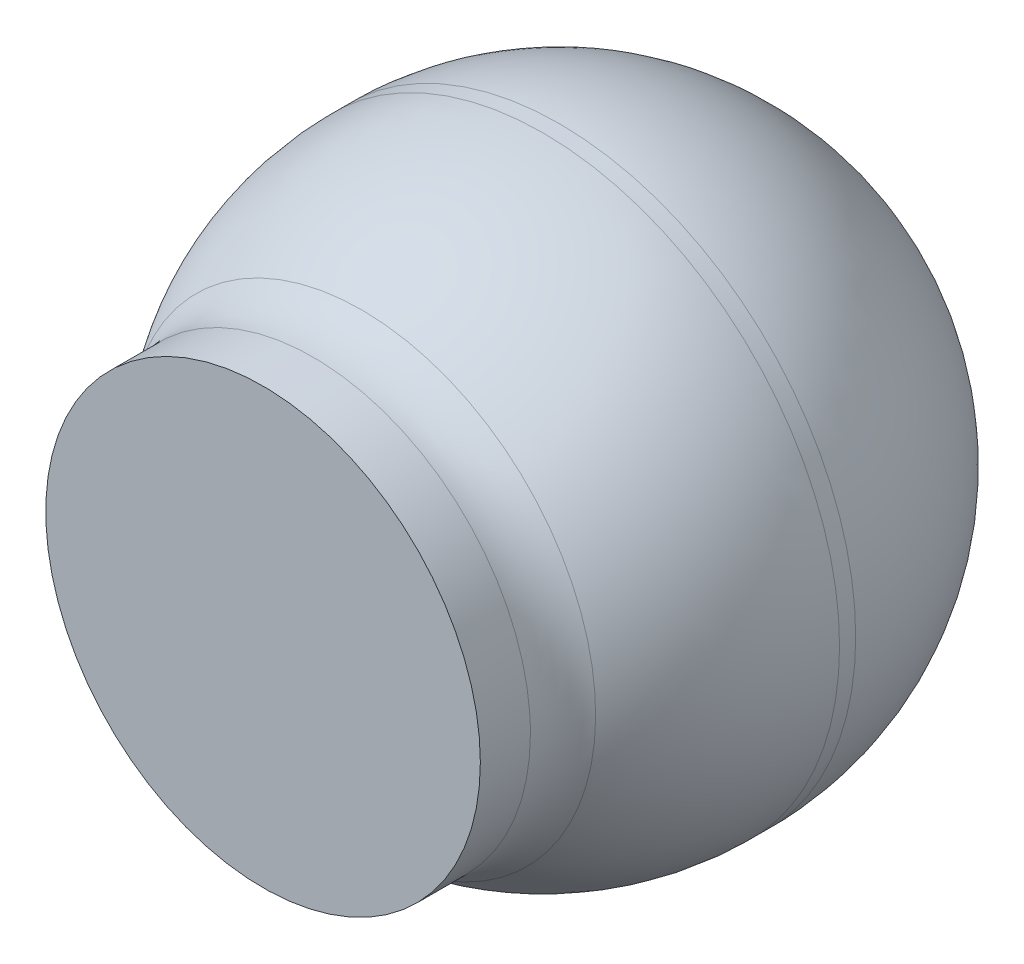
ISO-10303-21;
HEADER;
FILE_DESCRIPTION(('STEP AP214'),'2;1');
FILE_NAME('part.step','',(''),(''),'','','');
FILE_SCHEMA(('AUTOMOTIVE_DESIGN { 1 0 10303 214 1 1 1 1 }'));
ENDSEC;
DATA;
#1=APPLICATION_CONTEXT('core data for automotive mechanical design processes');
#2=APPLICATION_PROTOCOL_DEFINITION('international standard','automotive_design',2000,#1);
#3=PRODUCT_CONTEXT('',#1,'mechanical');
#4=PRODUCT('Part','Part','',(#3));
#5=PRODUCT_RELATED_PRODUCT_CATEGORY('part','',(#4));
#6=PRODUCT_DEFINITION_FORMATION('','',#4);
#7=PRODUCT_DEFINITION_CONTEXT('part definition',#1,'design');
#8=PRODUCT_DEFINITION('design','',#6,#7);
#9=PRODUCT_DEFINITION_SHAPE('','',#8);
#10=(LENGTH_UNIT() NAMED_UNIT(*) SI_UNIT(.MILLI.,.METRE.));
#11=(NAMED_UNIT(*) PLANE_ANGLE_UNIT() SI_UNIT($,.RADIAN.));
#12=(NAMED_UNIT(*) SI_UNIT($,.STERADIAN.) SOLID_ANGLE_UNIT());
#13=UNCERTAINTY_MEASURE_WITH_UNIT(LENGTH_MEASURE(1.E-05),#10,'distance_accuracy_value','');
#14=(GEOMETRIC_REPRESENTATION_CONTEXT(3) GLOBAL_UNCERTAINTY_ASSIGNED_CONTEXT((#13)) GLOBAL_UNIT_ASSIGNED_CONTEXT((#10,
#11,#12)) REPRESENTATION_CONTEXT('',''));
#15=CARTESIAN_POINT('',(0.,0.,0.));
#16=DIRECTION('',(0.,0.,1.));
#17=DIRECTION('',(1.,0.,0.));
#18=AXIS2_PLACEMENT_3D('',#15,#16,#17);
#19=CARTESIAN_POINT('',(-1.832919922269,-2.781349291452,10.006534503384));
#20=DIRECTION('',(0.,0.,-1.));
#21=DIRECTION('',(-1.,0.,0.));
#22=AXIS2_PLACEMENT_3D('',#19,#20,#21);
#23=PLANE('',#22);
#24=CARTESIAN_POINT('',(-1.832919922269,-2.781349291452,10.006534503384));
#25=DIRECTION('',(0.,0.,1.));
#26=DIRECTION('',(1.,0.,0.));
#27=AXIS2_PLACEMENT_3D('',#24,#25,#26);
#28=CIRCLE('',#27,0.275);
#29=CARTESIAN_POINT('',(-1.557919922269,-2.781349291452,10.006534503384));
#30=VERTEX_POINT('',#29);
#31=EDGE_CURVE('E20',#30,#30,#28,.F.);
#32=ORIENTED_EDGE('',*,*,#31,.F.);
#33=EDGE_LOOP('',(#32));
#34=FACE_BOUND('',#33,.T.);
#35=ADVANCED_FACE('F17',(#34),#23,.F.);
#36=CARTESIAN_POINT('',(-1.832919922269,-2.781349291452,9.906534503384));
#37=DIRECTION('',(0.,0.,1.));
#38=DIRECTION('',(1.,0.,0.));
#39=AXIS2_PLACEMENT_3D('',#36,#37,#38);
#40=CYLINDRICAL_SURFACE('',#39,0.275);
#41=CARTESIAN_POINT('',(-1.832919922269,-2.781349291452,9.943180457728));
#42=DIRECTION('',(0.,0.,-1.));
#43=DIRECTION('',(0.996700902337582,0.0811622527992454,0.));
#44=AXIS2_PLACEMENT_3D('',#41,#42,#43);
#45=CIRCLE('',#44,0.275);
#46=CARTESIAN_POINT('',(-1.55882717412616,-2.75902967193221,9.943180457728));
#47=VERTEX_POINT('',#46);
#48=EDGE_CURVE('E65',#47,#47,#45,.F.);
#49=ORIENTED_EDGE('',*,*,#48,.T.);
#50=EDGE_LOOP('',(#49));
#51=FACE_BOUND('',#50,.T.);
#52=ORIENTED_EDGE('',*,*,#31,.T.);
#53=EDGE_LOOP('',(#52));
#54=FACE_BOUND('',#53,.T.);
#55=ADVANCED_FACE('F62',(#51,#54),#40,.T.);
#56=CARTESIAN_POINT('',(-1.832919922269,-2.781349291452,9.943180457728));
#57=DIRECTION('',(0.,0.,-1.));
#58=DIRECTION('',(0.996700902337583,0.081162252799246,0.));
#59=AXIS2_PLACEMENT_3D('',#56,#57,#58);
#60=TOROIDAL_SURFACE('',#59,0.375,0.1);
#61=ORIENTED_EDGE('',*,*,#48,.F.);
#62=EDGE_LOOP('',(#61));
#63=FACE_BOUND('',#62,.T.);
#64=CARTESIAN_POINT('',(-1.832919922269,-2.781349291452,9.881744931236));
#65=DIRECTION('',(0.,0.,-1.));
#66=DIRECTION('',(-0.996700902337598,-0.0811622527990607,0.));
#67=AXIS2_PLACEMENT_3D('',#64,#65,#66);
#68=CIRCLE('',#67,0.296097046412665);
#69=CARTESIAN_POINT('',(-2.128040115608,-2.805381194786,9.881744931236));
#70=VERTEX_POINT('',#69);
#71=EDGE_CURVE('E39',#70,#70,#68,.T.);
#72=ORIENTED_EDGE('',*,*,#71,.F.);
#73=EDGE_LOOP('',(#72));
#74=FACE_BOUND('',#73,.T.);
#75=ADVANCED_FACE('F57',(#63,#74),#60,.F.);
#76=CARTESIAN_POINT('',(-2.206682760645,-2.811785136252,9.651976062157));
#77=CARTESIAN_POINT('',(-2.206682760645,-2.811785136252,9.701461392103));
#78=CARTESIAN_POINT('',(-2.198526217348,-2.811120941579,9.750947004335));
#79=CARTESIAN_POINT('',(-2.182207085349,-2.809792059952,9.798626332798));
#80=CARTESIAN_POINT('',(-2.158341390838,-2.807848654938,9.842699544317));
#81=CARTESIAN_POINT('',(-2.128040115608,-2.805381194786,9.881744931236));
#82=(BOUNDED_CURVE() B_SPLINE_CURVE(5,(#76,#77,#78,#79,#80,#81),.UNSPECIFIED.,.F.,
.F.) B_SPLINE_CURVE_WITH_KNOTS((6,6),(0.,0.661568582165),
.UNSPECIFIED.) CURVE() GEOMETRIC_REPRESENTATION_ITEM() RATIONAL_B_SPLINE_CURVE((1.,1.,1.,1.,1.,1.)) REPRESENTATION_ITEM(''));
#83=CARTESIAN_POINT('',(-1.832919922269,-2.781349291452,9.651976062157));
#84=DIRECTION('',(0.,0.,-1.));
#85=AXIS1_PLACEMENT('',#83,#84);
#86=SURFACE_OF_REVOLUTION('',#82,#85);
#87=CARTESIAN_POINT('',(-1.832919922269,-2.781349291452,9.651976062157));
#88=DIRECTION('',(0.,0.,1.));
#89=DIRECTION('',(1.,0.,0.));
#90=AXIS2_PLACEMENT_3D('',#87,#88,#89);
#91=CIRCLE('',#90,0.375);
#92=CARTESIAN_POINT('',(-1.457919922269,-2.781349291452,9.651976062157));
#93=VERTEX_POINT('',#92);
#94=EDGE_CURVE('E36',#93,#93,#91,.F.);
#95=ORIENTED_EDGE('',*,*,#94,.F.);
#96=EDGE_LOOP('',(#95));
#97=FACE_BOUND('',#96,.T.);
#98=ORIENTED_EDGE('',*,*,#71,.T.);
#99=EDGE_LOOP('',(#98));
#100=FACE_BOUND('',#99,.T.);
#101=ADVANCED_FACE('F53',(#97,#100),#86,.F.);
#102=CARTESIAN_POINT('',(-1.832919922269,-2.781349291452,9.256534503384));
#103=DIRECTION('',(0.,0.,1.));
#104=DIRECTION('',(1.,0.,0.));
#105=AXIS2_PLACEMENT_3D('',#102,#103,#104);
#106=CYLINDRICAL_SURFACE('',#105,0.375);
#107=CARTESIAN_POINT('',(-1.832919922269,-2.781349291452,9.631534503384));
#108=DIRECTION('',(0.,0.,-1.));
#109=DIRECTION('',(0.0811622527992361,-0.996700902337583,0.));
#110=AXIS2_PLACEMENT_3D('',#107,#108,#109);
#111=CIRCLE('',#110,0.375);
#112=CARTESIAN_POINT('',(-1.80248407746929,-3.15511212982859,9.631534503384));
#113=VERTEX_POINT('',#112);
#114=CARTESIAN_POINT('',(-1.86335576706871,-2.40758645307541,9.631534503384));
#115=VERTEX_POINT('',#114);
#116=EDGE_CURVE('E11',#113,#115,#111,.T.);
#117=ORIENTED_EDGE('',*,*,#116,.F.);
#118=CARTESIAN_POINT('',(-1.832919922269,-2.781349291452,9.631534503384));
#119=DIRECTION('',(0.,0.,1.));
#120=DIRECTION('',(0.081162252799236,-0.996700902337583,0.));
#121=AXIS2_PLACEMENT_3D('',#118,#119,#120);
#122=CIRCLE('',#121,0.375);
#123=EDGE_CURVE('E25',#115,#113,#122,.F.);
#124=ORIENTED_EDGE('',*,*,#123,.F.);
#125=EDGE_LOOP('',(#117,#124));
#126=FACE_BOUND('',#125,.T.);
#127=ORIENTED_EDGE('',*,*,#94,.T.);
#128=EDGE_LOOP('',(#127));
#129=FACE_BOUND('',#128,.T.);
#130=ADVANCED_FACE('F34',(#126,#129),#106,.T.);
#131=CARTESIAN_POINT('',(-1.832919922269,-2.781349291452,9.631534503384));
#132=DIRECTION('',(0.0811622527992361,-0.996700902337583,0.));
#133=DIRECTION('',(-0.996700902337583,-0.0811622527992361,0.));
#134=AXIS2_PLACEMENT_3D('',#131,#132,#133);
#135=SPHERICAL_SURFACE('',#134,0.375);
#136=ORIENTED_EDGE('',*,*,#123,.T.);
#137=ORIENTED_EDGE('',*,*,#116,.T.);
#138=EDGE_LOOP('',(#136,#137));
#139=FACE_BOUND('',#138,.T.);
#140=ADVANCED_FACE('F32',(#139),#135,.T.);
#141=CLOSED_SHELL('',(#35,#55,#75,#101,#130,#140));
#142=MANIFOLD_SOLID_BREP('B1',#141);
#143=ADVANCED_BREP_SHAPE_REPRESENTATION('',(#18,#142),#14);
#144=SHAPE_DEFINITION_REPRESENTATION(#9,#143);
ENDSEC;
END-ISO-10303-21;
